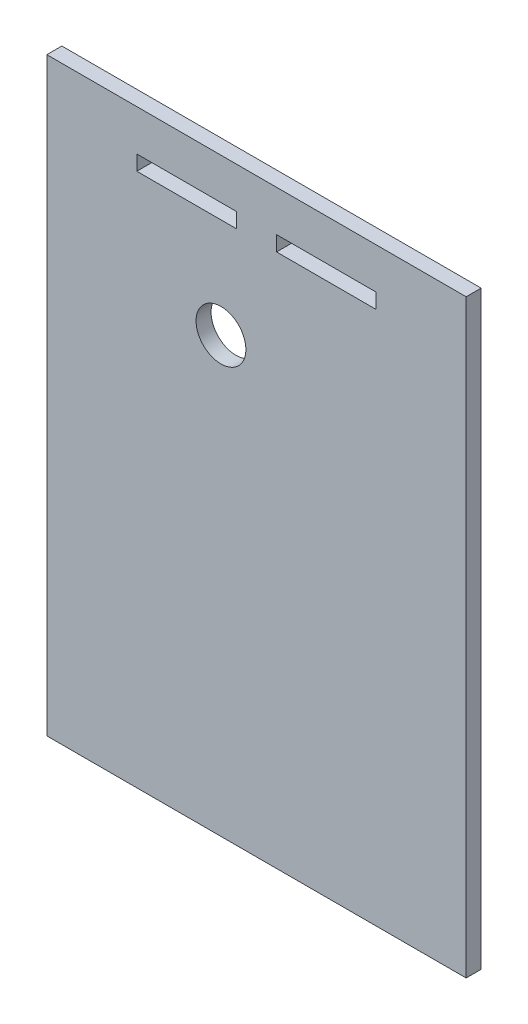
ISO-10303-21;
HEADER;
FILE_DESCRIPTION(('STEP AP214'),'2;1');
FILE_NAME('part.step','',(''),(''),'','','');
FILE_SCHEMA(('AUTOMOTIVE_DESIGN { 1 0 10303 214 1 1 1 1 }'));
ENDSEC;
DATA;
#1=APPLICATION_CONTEXT('core data for automotive mechanical design processes');
#2=APPLICATION_PROTOCOL_DEFINITION('international standard','automotive_design',2000,#1);
#3=PRODUCT_CONTEXT('',#1,'mechanical');
#4=PRODUCT('Part','Part','',(#3));
#5=PRODUCT_RELATED_PRODUCT_CATEGORY('part','',(#4));
#6=PRODUCT_DEFINITION_FORMATION('','',#4);
#7=PRODUCT_DEFINITION_CONTEXT('part definition',#1,'design');
#8=PRODUCT_DEFINITION('design','',#6,#7);
#9=PRODUCT_DEFINITION_SHAPE('','',#8);
#10=(LENGTH_UNIT() NAMED_UNIT(*) SI_UNIT(.MILLI.,.METRE.));
#11=(NAMED_UNIT(*) PLANE_ANGLE_UNIT() SI_UNIT($,.RADIAN.));
#12=(NAMED_UNIT(*) SI_UNIT($,.STERADIAN.) SOLID_ANGLE_UNIT());
#13=UNCERTAINTY_MEASURE_WITH_UNIT(LENGTH_MEASURE(1.E-05),#10,'distance_accuracy_value','');
#14=(GEOMETRIC_REPRESENTATION_CONTEXT(3) GLOBAL_UNCERTAINTY_ASSIGNED_CONTEXT((#13)) GLOBAL_UNIT_ASSIGNED_CONTEXT((#10,
#11,#12)) REPRESENTATION_CONTEXT('',''));
#15=CARTESIAN_POINT('',(0.,0.,0.));
#16=DIRECTION('',(0.,0.,1.));
#17=DIRECTION('',(1.,0.,0.));
#18=AXIS2_PLACEMENT_3D('',#15,#16,#17);
#19=CARTESIAN_POINT('',(0.,0.,3.));
#20=DIRECTION('',(0.,0.,-1.));
#21=DIRECTION('',(-1.,0.,0.));
#22=AXIS2_PLACEMENT_3D('',#19,#20,#21);
#23=PLANE('',#22);
#24=DIRECTION('',(0.,-1.,0.));
#25=VECTOR('',#24,1.);
#26=CARTESIAN_POINT('',(48.8695684618848,62.9695744572161,3.));
#27=LINE('',#26,#25);
#28=CARTESIAN_POINT('',(48.8695684618848,65.9695744572161,3.));
#29=VERTEX_POINT('',#28);
#30=CARTESIAN_POINT('',(48.8695684618848,62.9695744572161,3.));
#31=VERTEX_POINT('',#30);
#32=EDGE_CURVE('E160',#29,#31,#27,.T.);
#33=ORIENTED_EDGE('',*,*,#32,.F.);
#34=DIRECTION('',(-1.,0.,0.));
#35=VECTOR('',#34,1.);
#36=CARTESIAN_POINT('',(48.8695684618848,65.9695744572161,3.));
#37=LINE('',#36,#35);
#38=CARTESIAN_POINT('',(68.8019151285515,65.9695744572161,3.));
#39=VERTEX_POINT('',#38);
#40=EDGE_CURVE('E168',#39,#29,#37,.T.);
#41=ORIENTED_EDGE('',*,*,#40,.F.);
#42=DIRECTION('',(0.,1.,0.));
#43=VECTOR('',#42,1.);
#44=CARTESIAN_POINT('',(68.8019151285515,65.9695744572161,3.));
#45=LINE('',#44,#43);
#46=CARTESIAN_POINT('',(68.8019151285515,62.9695744572161,3.));
#47=VERTEX_POINT('',#46);
#48=EDGE_CURVE('E165',#47,#39,#45,.T.);
#49=ORIENTED_EDGE('',*,*,#48,.F.);
#50=DIRECTION('',(1.,0.,0.));
#51=VECTOR('',#50,1.);
#52=CARTESIAN_POINT('',(68.8019151285515,62.9695744572161,3.));
#53=LINE('',#52,#51);
#54=EDGE_CURVE('E162',#31,#47,#53,.T.);
#55=ORIENTED_EDGE('',*,*,#54,.F.);
#56=EDGE_LOOP('',(#33,#41,#49,#55));
#57=FACE_BOUND('',#56,.T.);
#58=DIRECTION('',(0.,1.,0.));
#59=VECTOR('',#58,1.);
#60=CARTESIAN_POINT('',(86.7919551285515,74.1695744572161,3.));
#61=LINE('',#60,#59);
#62=CARTESIAN_POINT('',(86.7919551285515,-43.830425542784,3.));
#63=VERTEX_POINT('',#62);
#64=CARTESIAN_POINT('',(86.7919551285515,74.1695744572161,3.));
#65=VERTEX_POINT('',#64);
#66=EDGE_CURVE('E191',#63,#65,#61,.T.);
#67=ORIENTED_EDGE('',*,*,#66,.T.);
#68=DIRECTION('',(-1.,0.,0.));
#69=VECTOR('',#68,1.);
#70=CARTESIAN_POINT('',(2.92528846188485,74.1695744572161,3.));
#71=LINE('',#70,#69);
#72=CARTESIAN_POINT('',(2.92528846188485,74.1695744572161,3.));
#73=VERTEX_POINT('',#72);
#74=EDGE_CURVE('E194',#65,#73,#71,.T.);
#75=ORIENTED_EDGE('',*,*,#74,.T.);
#76=DIRECTION('',(0.,-1.,0.));
#77=VECTOR('',#76,1.);
#78=CARTESIAN_POINT('',(2.92528846188486,34.4690983820124,3.));
#79=LINE('',#78,#77);
#80=CARTESIAN_POINT('',(2.92528846188486,-43.8304255427839,3.));
#81=VERTEX_POINT('',#80);
#82=EDGE_CURVE('E197',#73,#81,#79,.T.);
#83=ORIENTED_EDGE('',*,*,#82,.T.);
#84=DIRECTION('',(1.,0.,0.));
#85=VECTOR('',#84,1.);
#86=CARTESIAN_POINT('',(86.7919551285515,-43.830425542784,3.));
#87=LINE('',#86,#85);
#88=EDGE_CURVE('E199',#81,#63,#87,.T.);
#89=ORIENTED_EDGE('',*,*,#88,.T.);
#90=EDGE_LOOP('',(#67,#75,#83,#89));
#91=FACE_BOUND('',#90,.T.);
#92=DIRECTION('',(1.,0.,0.));
#93=VECTOR('',#92,1.);
#94=CARTESIAN_POINT('',(40.8476751285515,62.9695744572161,3.));
#95=LINE('',#94,#93);
#96=CARTESIAN_POINT('',(20.9153284618848,62.9695744572161,3.));
#97=VERTEX_POINT('',#96);
#98=CARTESIAN_POINT('',(40.8476751285515,62.9695744572161,3.));
#99=VERTEX_POINT('',#98);
#100=EDGE_CURVE('E121',#97,#99,#95,.T.);
#101=ORIENTED_EDGE('',*,*,#100,.F.);
#102=DIRECTION('',(0.,-1.,0.));
#103=VECTOR('',#102,1.);
#104=CARTESIAN_POINT('',(20.9153284618848,62.9695744572161,3.));
#105=LINE('',#104,#103);
#106=CARTESIAN_POINT('',(20.9153284618848,65.9695744572161,3.));
#107=VERTEX_POINT('',#106);
#108=EDGE_CURVE('E144',#107,#97,#105,.T.);
#109=ORIENTED_EDGE('',*,*,#108,.F.);
#110=DIRECTION('',(-1.,0.,0.));
#111=VECTOR('',#110,1.);
#112=CARTESIAN_POINT('',(20.9153284618848,65.9695744572161,3.));
#113=LINE('',#112,#111);
#114=CARTESIAN_POINT('',(40.8476751285515,65.9695744572161,3.));
#115=VERTEX_POINT('',#114);
#116=EDGE_CURVE('E142',#115,#107,#113,.T.);
#117=ORIENTED_EDGE('',*,*,#116,.F.);
#118=DIRECTION('',(0.,1.,0.));
#119=VECTOR('',#118,1.);
#120=CARTESIAN_POINT('',(40.8476751285515,65.9695744572161,3.));
#121=LINE('',#120,#119);
#122=EDGE_CURVE('E129',#99,#115,#121,.T.);
#123=ORIENTED_EDGE('',*,*,#122,.F.);
#124=EDGE_LOOP('',(#101,#109,#117,#123));
#125=FACE_BOUND('',#124,.T.);
#126=CARTESIAN_POINT('',(37.7504002277656,42.9904576963416,3.));
#127=DIRECTION('',(0.,0.,1.));
#128=DIRECTION('',(1.,0.,0.));
#129=AXIS2_PLACEMENT_3D('',#126,#127,#128);
#130=CIRCLE('',#129,4.98401205119356);
#131=CARTESIAN_POINT('',(42.7344122789591,42.9904576963416,3.));
#132=VERTEX_POINT('',#131);
#133=EDGE_CURVE('E150',#132,#132,#130,.T.);
#134=ORIENTED_EDGE('',*,*,#133,.F.);
#135=EDGE_LOOP('',(#134));
#136=FACE_BOUND('',#135,.T.);
#137=ADVANCED_FACE('F32',(#57,#91,#125,#136),#23,.F.);
#138=CARTESIAN_POINT('',(0.,0.,0.));
#139=DIRECTION('',(0.,0.,-1.));
#140=DIRECTION('',(-1.,0.,0.));
#141=AXIS2_PLACEMENT_3D('',#138,#139,#140);
#142=PLANE('',#141);
#143=DIRECTION('',(0.,-1.,0.));
#144=VECTOR('',#143,1.);
#145=CARTESIAN_POINT('',(20.9153284618848,62.9695744572161,0.));
#146=LINE('',#145,#144);
#147=CARTESIAN_POINT('',(20.9153284618848,65.9695744572161,0.));
#148=VERTEX_POINT('',#147);
#149=CARTESIAN_POINT('',(20.9153284618848,62.9695744572161,0.));
#150=VERTEX_POINT('',#149);
#151=EDGE_CURVE('E130',#148,#150,#146,.T.);
#152=ORIENTED_EDGE('',*,*,#151,.T.);
#153=DIRECTION('',(1.,0.,0.));
#154=VECTOR('',#153,1.);
#155=CARTESIAN_POINT('',(40.8476751285515,62.9695744572161,0.));
#156=LINE('',#155,#154);
#157=CARTESIAN_POINT('',(40.8476751285515,62.9695744572161,0.));
#158=VERTEX_POINT('',#157);
#159=EDGE_CURVE('E55',#150,#158,#156,.T.);
#160=ORIENTED_EDGE('',*,*,#159,.T.);
#161=DIRECTION('',(0.,1.,0.));
#162=VECTOR('',#161,1.);
#163=CARTESIAN_POINT('',(40.8476751285515,65.9695744572161,0.));
#164=LINE('',#163,#162);
#165=CARTESIAN_POINT('',(40.8476751285515,65.9695744572161,0.));
#166=VERTEX_POINT('',#165);
#167=EDGE_CURVE('E136',#158,#166,#164,.T.);
#168=ORIENTED_EDGE('',*,*,#167,.T.);
#169=DIRECTION('',(-1.,0.,0.));
#170=VECTOR('',#169,1.);
#171=CARTESIAN_POINT('',(20.9153284618848,65.9695744572161,0.));
#172=LINE('',#171,#170);
#173=EDGE_CURVE('E152',#166,#148,#172,.T.);
#174=ORIENTED_EDGE('',*,*,#173,.T.);
#175=EDGE_LOOP('',(#152,#160,#168,#174));
#176=FACE_BOUND('',#175,.T.);
#177=DIRECTION('',(-1.,0.,0.));
#178=VECTOR('',#177,1.);
#179=CARTESIAN_POINT('',(48.8695684618848,65.9695744572161,0.));
#180=LINE('',#179,#178);
#181=CARTESIAN_POINT('',(68.8019151285515,65.9695744572161,0.));
#182=VERTEX_POINT('',#181);
#183=CARTESIAN_POINT('',(48.8695684618848,65.9695744572161,0.));
#184=VERTEX_POINT('',#183);
#185=EDGE_CURVE('E163',#182,#184,#180,.T.);
#186=ORIENTED_EDGE('',*,*,#185,.T.);
#187=DIRECTION('',(0.,-1.,0.));
#188=VECTOR('',#187,1.);
#189=CARTESIAN_POINT('',(48.8695684618848,62.9695744572161,0.));
#190=LINE('',#189,#188);
#191=CARTESIAN_POINT('',(48.8695684618848,62.9695744572161,0.));
#192=VERTEX_POINT('',#191);
#193=EDGE_CURVE('E137',#184,#192,#190,.T.);
#194=ORIENTED_EDGE('',*,*,#193,.T.);
#195=DIRECTION('',(1.,0.,0.));
#196=VECTOR('',#195,1.);
#197=CARTESIAN_POINT('',(68.8019151285515,62.9695744572161,0.));
#198=LINE('',#197,#196);
#199=CARTESIAN_POINT('',(68.8019151285515,62.9695744572161,0.));
#200=VERTEX_POINT('',#199);
#201=EDGE_CURVE('E173',#192,#200,#198,.T.);
#202=ORIENTED_EDGE('',*,*,#201,.T.);
#203=DIRECTION('',(0.,1.,0.));
#204=VECTOR('',#203,1.);
#205=CARTESIAN_POINT('',(68.8019151285515,65.9695744572161,0.));
#206=LINE('',#205,#204);
#207=EDGE_CURVE('E176',#200,#182,#206,.T.);
#208=ORIENTED_EDGE('',*,*,#207,.T.);
#209=EDGE_LOOP('',(#186,#194,#202,#208));
#210=FACE_BOUND('',#209,.T.);
#211=DIRECTION('',(0.,1.,0.));
#212=VECTOR('',#211,1.);
#213=CARTESIAN_POINT('',(86.7919551285515,74.1695744572161,0.));
#214=LINE('',#213,#212);
#215=CARTESIAN_POINT('',(86.7919551285515,-43.830425542784,0.));
#216=VERTEX_POINT('',#215);
#217=CARTESIAN_POINT('',(86.7919551285515,74.1695744572161,0.));
#218=VERTEX_POINT('',#217);
#219=EDGE_CURVE('E190',#216,#218,#214,.T.);
#220=ORIENTED_EDGE('',*,*,#219,.F.);
#221=DIRECTION('',(1.,0.,0.));
#222=VECTOR('',#221,1.);
#223=CARTESIAN_POINT('',(86.7919551285515,-43.830425542784,0.));
#224=LINE('',#223,#222);
#225=CARTESIAN_POINT('',(2.92528846188486,-43.8304255427839,0.));
#226=VERTEX_POINT('',#225);
#227=EDGE_CURVE('E195',#226,#216,#224,.T.);
#228=ORIENTED_EDGE('',*,*,#227,.F.);
#229=DIRECTION('',(0.,-1.,0.));
#230=VECTOR('',#229,1.);
#231=CARTESIAN_POINT('',(2.92528846188486,34.4690983820124,0.));
#232=LINE('',#231,#230);
#233=CARTESIAN_POINT('',(2.92528846188485,74.1695744572161,0.));
#234=VERTEX_POINT('',#233);
#235=EDGE_CURVE('E207',#234,#226,#232,.T.);
#236=ORIENTED_EDGE('',*,*,#235,.F.);
#237=DIRECTION('',(-1.,0.,0.));
#238=VECTOR('',#237,1.);
#239=CARTESIAN_POINT('',(2.92528846188485,74.1695744572161,0.));
#240=LINE('',#239,#238);
#241=EDGE_CURVE('E204',#218,#234,#240,.T.);
#242=ORIENTED_EDGE('',*,*,#241,.F.);
#243=EDGE_LOOP('',(#220,#228,#236,#242));
#244=FACE_BOUND('',#243,.T.);
#245=CARTESIAN_POINT('',(37.7504002277656,42.9904576963416,0.));
#246=DIRECTION('',(0.,0.,1.));
#247=DIRECTION('',(1.,0.,0.));
#248=AXIS2_PLACEMENT_3D('',#245,#246,#247);
#249=CIRCLE('',#248,4.98401205119356);
#250=CARTESIAN_POINT('',(42.7344122789591,42.9904576963416,0.));
#251=VERTEX_POINT('',#250);
#252=EDGE_CURVE('E377',#251,#251,#249,.T.);
#253=ORIENTED_EDGE('',*,*,#252,.T.);
#254=EDGE_LOOP('',(#253));
#255=FACE_BOUND('',#254,.T.);
#256=ADVANCED_FACE('F225',(#176,#210,#244,#255),#142,.T.);
#257=CARTESIAN_POINT('',(86.7919551285515,74.1695744572161,3.));
#258=DIRECTION('',(-1.,0.,0.));
#259=DIRECTION('',(0.,0.,1.));
#260=AXIS2_PLACEMENT_3D('',#257,#258,#259);
#261=PLANE('',#260);
#262=ORIENTED_EDGE('',*,*,#219,.T.);
#263=DIRECTION('',(0.,0.,-1.));
#264=VECTOR('',#263,1.);
#265=CARTESIAN_POINT('',(86.7919551285515,74.1695744572161,3.));
#266=LINE('',#265,#264);
#267=EDGE_CURVE('E11',#65,#218,#266,.T.);
#268=ORIENTED_EDGE('',*,*,#267,.F.);
#269=ORIENTED_EDGE('',*,*,#66,.F.);
#270=DIRECTION('',(0.,0.,-1.));
#271=VECTOR('',#270,1.);
#272=CARTESIAN_POINT('',(86.7919551285515,-43.830425542784,3.));
#273=LINE('',#272,#271);
#274=EDGE_CURVE('E201',#63,#216,#273,.T.);
#275=ORIENTED_EDGE('',*,*,#274,.T.);
#276=EDGE_LOOP('',(#262,#268,#269,#275));
#277=FACE_BOUND('',#276,.T.);
#278=ADVANCED_FACE('F34',(#277),#261,.F.);
#279=CARTESIAN_POINT('',(2.92528846188485,74.1695744572161,3.));
#280=DIRECTION('',(0.,-1.,0.));
#281=DIRECTION('',(0.,0.,-1.));
#282=AXIS2_PLACEMENT_3D('',#279,#280,#281);
#283=PLANE('',#282);
#284=ORIENTED_EDGE('',*,*,#241,.T.);
#285=DIRECTION('',(0.,0.,-1.));
#286=VECTOR('',#285,1.);
#287=CARTESIAN_POINT('',(2.92528846188485,74.1695744572161,3.));
#288=LINE('',#287,#286);
#289=EDGE_CURVE('E40',#73,#234,#288,.T.);
#290=ORIENTED_EDGE('',*,*,#289,.F.);
#291=ORIENTED_EDGE('',*,*,#74,.F.);
#292=ORIENTED_EDGE('',*,*,#267,.T.);
#293=EDGE_LOOP('',(#284,#290,#291,#292));
#294=FACE_BOUND('',#293,.T.);
#295=ADVANCED_FACE('F221',(#294),#283,.F.);
#296=CARTESIAN_POINT('',(2.92528846188486,34.4690983820124,3.));
#297=DIRECTION('',(1.,0.,0.));
#298=DIRECTION('',(0.,0.,-1.));
#299=AXIS2_PLACEMENT_3D('',#296,#297,#298);
#300=PLANE('',#299);
#301=ORIENTED_EDGE('',*,*,#235,.T.);
#302=DIRECTION('',(0.,0.,-1.));
#303=VECTOR('',#302,1.);
#304=CARTESIAN_POINT('',(2.92528846188486,-43.8304255427839,3.));
#305=LINE('',#304,#303);
#306=EDGE_CURVE('E212',#81,#226,#305,.T.);
#307=ORIENTED_EDGE('',*,*,#306,.F.);
#308=ORIENTED_EDGE('',*,*,#82,.F.);
#309=ORIENTED_EDGE('',*,*,#289,.T.);
#310=EDGE_LOOP('',(#301,#307,#308,#309));
#311=FACE_BOUND('',#310,.T.);
#312=ADVANCED_FACE('F218',(#311),#300,.F.);
#313=CARTESIAN_POINT('',(86.7919551285515,-43.830425542784,3.));
#314=DIRECTION('',(0.,1.,0.));
#315=DIRECTION('',(-1.,0.,0.));
#316=AXIS2_PLACEMENT_3D('',#313,#314,#315);
#317=PLANE('',#316);
#318=ORIENTED_EDGE('',*,*,#227,.T.);
#319=ORIENTED_EDGE('',*,*,#274,.F.);
#320=ORIENTED_EDGE('',*,*,#88,.F.);
#321=ORIENTED_EDGE('',*,*,#306,.T.);
#322=EDGE_LOOP('',(#318,#319,#320,#321));
#323=FACE_BOUND('',#322,.T.);
#324=ADVANCED_FACE('F230',(#323),#317,.F.);
#325=CARTESIAN_POINT('',(48.8695684618848,62.9695744572161,3.));
#326=DIRECTION('',(1.,0.,0.));
#327=DIRECTION('',(0.,0.,-1.));
#328=AXIS2_PLACEMENT_3D('',#325,#326,#327);
#329=PLANE('',#328);
#330=ORIENTED_EDGE('',*,*,#193,.F.);
#331=DIRECTION('',(0.,0.,-1.));
#332=VECTOR('',#331,1.);
#333=CARTESIAN_POINT('',(48.8695684618848,65.9695744572161,3.));
#334=LINE('',#333,#332);
#335=EDGE_CURVE('E170',#29,#184,#334,.T.);
#336=ORIENTED_EDGE('',*,*,#335,.F.);
#337=ORIENTED_EDGE('',*,*,#32,.T.);
#338=DIRECTION('',(0.,0.,-1.));
#339=VECTOR('',#338,1.);
#340=CARTESIAN_POINT('',(48.8695684618848,62.9695744572161,3.));
#341=LINE('',#340,#339);
#342=EDGE_CURVE('E187',#31,#192,#341,.T.);
#343=ORIENTED_EDGE('',*,*,#342,.T.);
#344=EDGE_LOOP('',(#330,#336,#337,#343));
#345=FACE_BOUND('',#344,.T.);
#346=ADVANCED_FACE('F245',(#345),#329,.T.);
#347=CARTESIAN_POINT('',(68.8019151285515,62.9695744572161,3.));
#348=DIRECTION('',(0.,1.,0.));
#349=DIRECTION('',(0.,0.,1.));
#350=AXIS2_PLACEMENT_3D('',#347,#348,#349);
#351=PLANE('',#350);
#352=ORIENTED_EDGE('',*,*,#201,.F.);
#353=ORIENTED_EDGE('',*,*,#342,.F.);
#354=ORIENTED_EDGE('',*,*,#54,.T.);
#355=DIRECTION('',(0.,0.,-1.));
#356=VECTOR('',#355,1.);
#357=CARTESIAN_POINT('',(68.8019151285515,62.9695744572161,3.));
#358=LINE('',#357,#356);
#359=EDGE_CURVE('E185',#47,#200,#358,.T.);
#360=ORIENTED_EDGE('',*,*,#359,.T.);
#361=EDGE_LOOP('',(#352,#353,#354,#360));
#362=FACE_BOUND('',#361,.T.);
#363=ADVANCED_FACE('F294',(#362),#351,.T.);
#364=CARTESIAN_POINT('',(68.8019151285515,65.9695744572161,3.));
#365=DIRECTION('',(-1.,0.,0.));
#366=DIRECTION('',(0.,0.,1.));
#367=AXIS2_PLACEMENT_3D('',#364,#365,#366);
#368=PLANE('',#367);
#369=ORIENTED_EDGE('',*,*,#207,.F.);
#370=ORIENTED_EDGE('',*,*,#359,.F.);
#371=ORIENTED_EDGE('',*,*,#48,.T.);
#372=DIRECTION('',(0.,0.,-1.));
#373=VECTOR('',#372,1.);
#374=CARTESIAN_POINT('',(68.8019151285515,65.9695744572161,3.));
#375=LINE('',#374,#373);
#376=EDGE_CURVE('E183',#39,#182,#375,.T.);
#377=ORIENTED_EDGE('',*,*,#376,.T.);
#378=EDGE_LOOP('',(#369,#370,#371,#377));
#379=FACE_BOUND('',#378,.T.);
#380=ADVANCED_FACE('F302',(#379),#368,.T.);
#381=CARTESIAN_POINT('',(48.8695684618848,65.9695744572161,3.));
#382=DIRECTION('',(0.,-1.,0.));
#383=DIRECTION('',(0.,0.,-1.));
#384=AXIS2_PLACEMENT_3D('',#381,#382,#383);
#385=PLANE('',#384);
#386=ORIENTED_EDGE('',*,*,#185,.F.);
#387=ORIENTED_EDGE('',*,*,#376,.F.);
#388=ORIENTED_EDGE('',*,*,#40,.T.);
#389=ORIENTED_EDGE('',*,*,#335,.T.);
#390=EDGE_LOOP('',(#386,#387,#388,#389));
#391=FACE_BOUND('',#390,.T.);
#392=ADVANCED_FACE('F310',(#391),#385,.T.);
#393=CARTESIAN_POINT('',(40.8476751285515,62.9695744572161,3.));
#394=DIRECTION('',(0.,1.,0.));
#395=DIRECTION('',(0.,0.,1.));
#396=AXIS2_PLACEMENT_3D('',#393,#394,#395);
#397=PLANE('',#396);
#398=ORIENTED_EDGE('',*,*,#159,.F.);
#399=DIRECTION('',(0.,0.,-1.));
#400=VECTOR('',#399,1.);
#401=CARTESIAN_POINT('',(20.9153284618848,62.9695744572161,3.));
#402=LINE('',#401,#400);
#403=EDGE_CURVE('E125',#97,#150,#402,.T.);
#404=ORIENTED_EDGE('',*,*,#403,.F.);
#405=ORIENTED_EDGE('',*,*,#100,.T.);
#406=DIRECTION('',(0.,0.,-1.));
#407=VECTOR('',#406,1.);
#408=CARTESIAN_POINT('',(40.8476751285515,62.9695744572161,3.));
#409=LINE('',#408,#407);
#410=EDGE_CURVE('E124',#99,#158,#409,.T.);
#411=ORIENTED_EDGE('',*,*,#410,.T.);
#412=EDGE_LOOP('',(#398,#404,#405,#411));
#413=FACE_BOUND('',#412,.T.);
#414=ADVANCED_FACE('F123',(#413),#397,.T.);
#415=CARTESIAN_POINT('',(40.8476751285515,65.9695744572161,3.));
#416=DIRECTION('',(-1.,0.,0.));
#417=DIRECTION('',(0.,0.,1.));
#418=AXIS2_PLACEMENT_3D('',#415,#416,#417);
#419=PLANE('',#418);
#420=ORIENTED_EDGE('',*,*,#167,.F.);
#421=ORIENTED_EDGE('',*,*,#410,.F.);
#422=ORIENTED_EDGE('',*,*,#122,.T.);
#423=DIRECTION('',(0.,0.,-1.));
#424=VECTOR('',#423,1.);
#425=CARTESIAN_POINT('',(40.8476751285515,65.9695744572161,3.));
#426=LINE('',#425,#424);
#427=EDGE_CURVE('E138',#115,#166,#426,.T.);
#428=ORIENTED_EDGE('',*,*,#427,.T.);
#429=EDGE_LOOP('',(#420,#421,#422,#428));
#430=FACE_BOUND('',#429,.T.);
#431=ADVANCED_FACE('F133',(#430),#419,.T.);
#432=CARTESIAN_POINT('',(20.9153284618848,65.9695744572161,3.));
#433=DIRECTION('',(0.,-1.,0.));
#434=DIRECTION('',(0.,0.,-1.));
#435=AXIS2_PLACEMENT_3D('',#432,#433,#434);
#436=PLANE('',#435);
#437=ORIENTED_EDGE('',*,*,#173,.F.);
#438=ORIENTED_EDGE('',*,*,#427,.F.);
#439=ORIENTED_EDGE('',*,*,#116,.T.);
#440=DIRECTION('',(0.,0.,-1.));
#441=VECTOR('',#440,1.);
#442=CARTESIAN_POINT('',(20.9153284618848,65.9695744572161,3.));
#443=LINE('',#442,#441);
#444=EDGE_CURVE('E47',#107,#148,#443,.T.);
#445=ORIENTED_EDGE('',*,*,#444,.T.);
#446=EDGE_LOOP('',(#437,#438,#439,#445));
#447=FACE_BOUND('',#446,.T.);
#448=ADVANCED_FACE('F334',(#447),#436,.T.);
#449=CARTESIAN_POINT('',(20.9153284618848,62.9695744572161,3.));
#450=DIRECTION('',(1.,0.,0.));
#451=DIRECTION('',(0.,0.,-1.));
#452=AXIS2_PLACEMENT_3D('',#449,#450,#451);
#453=PLANE('',#452);
#454=ORIENTED_EDGE('',*,*,#151,.F.);
#455=ORIENTED_EDGE('',*,*,#444,.F.);
#456=ORIENTED_EDGE('',*,*,#108,.T.);
#457=ORIENTED_EDGE('',*,*,#403,.T.);
#458=EDGE_LOOP('',(#454,#455,#456,#457));
#459=FACE_BOUND('',#458,.T.);
#460=ADVANCED_FACE('F342',(#459),#453,.T.);
#461=CARTESIAN_POINT('',(37.7504002277656,42.9904576963416,3.));
#462=DIRECTION('',(0.,0.,-1.));
#463=DIRECTION('',(-1.,0.,0.));
#464=AXIS2_PLACEMENT_3D('',#461,#462,#463);
#465=CYLINDRICAL_SURFACE('',#464,4.98401205119356);
#466=ORIENTED_EDGE('',*,*,#133,.T.);
#467=EDGE_LOOP('',(#466));
#468=FACE_BOUND('',#467,.T.);
#469=ORIENTED_EDGE('',*,*,#252,.F.);
#470=EDGE_LOOP('',(#469));
#471=FACE_BOUND('',#470,.T.);
#472=ADVANCED_FACE('F351',(#468,#471),#465,.F.);
#473=CLOSED_SHELL('',(#137,#256,#278,#295,#312,#324,#346,#363,#380,#392,#414,#431,#448,#460,#472));
#474=MANIFOLD_SOLID_BREP('B2',#473);
#475=ADVANCED_BREP_SHAPE_REPRESENTATION('',(#18,#474),#14);
#476=SHAPE_DEFINITION_REPRESENTATION(#9,#475);
ENDSEC;
END-ISO-10303-21;
